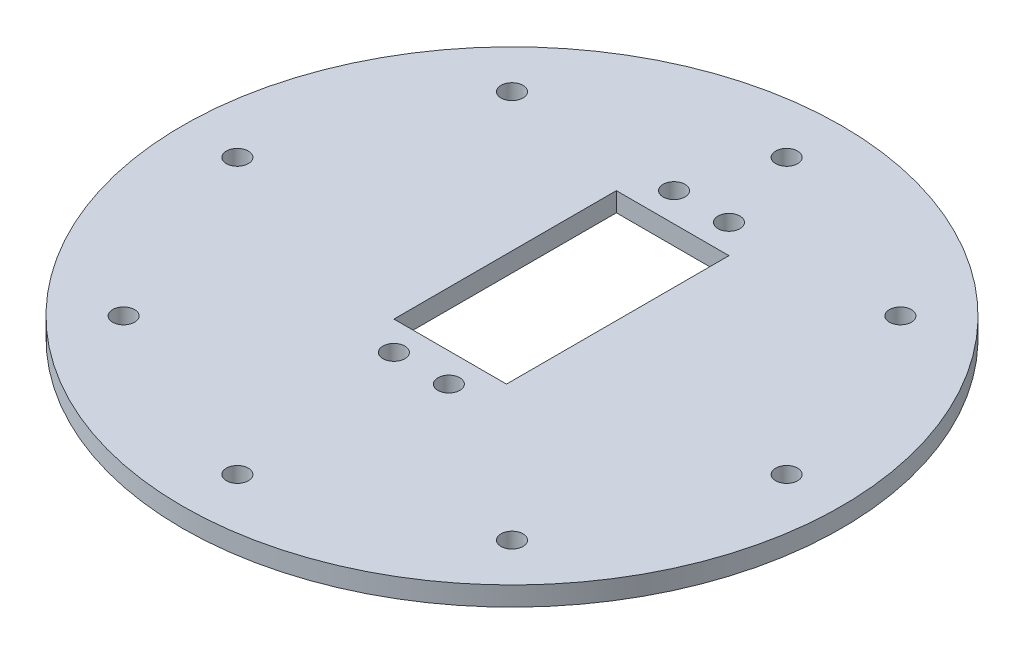
ISO-10303-21;
HEADER;
FILE_DESCRIPTION(('STEP AP214'),'2;1');
FILE_NAME('part.step','',(''),(''),'','','');
FILE_SCHEMA(('AUTOMOTIVE_DESIGN { 1 0 10303 214 1 1 1 1 }'));
ENDSEC;
DATA;
#1=APPLICATION_CONTEXT('core data for automotive mechanical design processes');
#2=APPLICATION_PROTOCOL_DEFINITION('international standard','automotive_design',2000,#1);
#3=PRODUCT_CONTEXT('',#1,'mechanical');
#4=PRODUCT('Part','Part','',(#3));
#5=PRODUCT_RELATED_PRODUCT_CATEGORY('part','',(#4));
#6=PRODUCT_DEFINITION_FORMATION('','',#4);
#7=PRODUCT_DEFINITION_CONTEXT('part definition',#1,'design');
#8=PRODUCT_DEFINITION('design','',#6,#7);
#9=PRODUCT_DEFINITION_SHAPE('','',#8);
#10=(LENGTH_UNIT() NAMED_UNIT(*) SI_UNIT(.MILLI.,.METRE.));
#11=(NAMED_UNIT(*) PLANE_ANGLE_UNIT() SI_UNIT($,.RADIAN.));
#12=(NAMED_UNIT(*) SI_UNIT($,.STERADIAN.) SOLID_ANGLE_UNIT());
#13=UNCERTAINTY_MEASURE_WITH_UNIT(LENGTH_MEASURE(1.E-05),#10,'distance_accuracy_value','');
#14=(GEOMETRIC_REPRESENTATION_CONTEXT(3) GLOBAL_UNCERTAINTY_ASSIGNED_CONTEXT((#13)) GLOBAL_UNIT_ASSIGNED_CONTEXT((#10,
#11,#12)) REPRESENTATION_CONTEXT('',''));
#15=CARTESIAN_POINT('',(0.,0.,0.));
#16=DIRECTION('',(0.,0.,1.));
#17=DIRECTION('',(1.,0.,0.));
#18=AXIS2_PLACEMENT_3D('',#15,#16,#17);
#19=CARTESIAN_POINT('',(0.,3.5,0.));
#20=DIRECTION('',(0.,-1.,0.));
#21=DIRECTION('',(0.,0.,-1.));
#22=AXIS2_PLACEMENT_3D('',#19,#20,#21);
#23=CYLINDRICAL_SURFACE('',#22,60.);
#24=CARTESIAN_POINT('',(0.,3.5,0.));
#25=DIRECTION('',(0.,1.,0.));
#26=DIRECTION('',(0.,0.,1.));
#27=AXIS2_PLACEMENT_3D('',#24,#25,#26);
#28=CIRCLE('',#27,60.);
#29=CARTESIAN_POINT('',(0.,3.5,60.));
#30=VERTEX_POINT('',#29);
#31=EDGE_CURVE('E11',#30,#30,#28,.T.);
#32=ORIENTED_EDGE('',*,*,#31,.F.);
#33=EDGE_LOOP('',(#32));
#34=FACE_BOUND('',#33,.T.);
#35=CARTESIAN_POINT('',(0.,0.,0.));
#36=DIRECTION('',(0.,1.,0.));
#37=DIRECTION('',(0.,0.,1.));
#38=AXIS2_PLACEMENT_3D('',#35,#36,#37);
#39=CIRCLE('',#38,60.);
#40=CARTESIAN_POINT('',(0.,0.,60.));
#41=VERTEX_POINT('',#40);
#42=EDGE_CURVE('E43',#41,#41,#39,.T.);
#43=ORIENTED_EDGE('',*,*,#42,.T.);
#44=EDGE_LOOP('',(#43));
#45=FACE_BOUND('',#44,.T.);
#46=ADVANCED_FACE('F40',(#34,#45),#23,.T.);
#47=CARTESIAN_POINT('',(0.,3.5,0.));
#48=DIRECTION('',(0.,1.,0.));
#49=DIRECTION('',(0.,0.,1.));
#50=AXIS2_PLACEMENT_3D('',#47,#48,#49);
#51=PLANE('',#50);
#52=CARTESIAN_POINT('',(5.,3.5,16.5));
#53=DIRECTION('',(0.,1.,0.));
#54=DIRECTION('',(0.,0.,-1.));
#55=AXIS2_PLACEMENT_3D('',#52,#53,#54);
#56=CIRCLE('',#55,2.);
#57=CARTESIAN_POINT('',(5.,3.5,14.5));
#58=VERTEX_POINT('',#57);
#59=EDGE_CURVE('E437',#58,#58,#56,.T.);
#60=ORIENTED_EDGE('',*,*,#59,.F.);
#61=EDGE_LOOP('',(#60));
#62=FACE_BOUND('',#61,.T.);
#63=CARTESIAN_POINT('',(-5.,3.5,16.5));
#64=DIRECTION('',(0.,1.,0.));
#65=DIRECTION('',(0.,0.,1.));
#66=AXIS2_PLACEMENT_3D('',#63,#64,#65);
#67=CIRCLE('',#66,2.);
#68=CARTESIAN_POINT('',(-5.,3.5,18.5));
#69=VERTEX_POINT('',#68);
#70=EDGE_CURVE('E444',#69,#69,#67,.T.);
#71=ORIENTED_EDGE('',*,*,#70,.F.);
#72=EDGE_LOOP('',(#71));
#73=FACE_BOUND('',#72,.T.);
#74=CARTESIAN_POINT('',(-5.,3.5,-34.5));
#75=DIRECTION('',(0.,1.,0.));
#76=DIRECTION('',(0.,0.,-1.));
#77=AXIS2_PLACEMENT_3D('',#74,#75,#76);
#78=CIRCLE('',#77,2.);
#79=CARTESIAN_POINT('',(-5.,3.5,-36.5));
#80=VERTEX_POINT('',#79);
#81=EDGE_CURVE('E436',#80,#80,#78,.T.);
#82=ORIENTED_EDGE('',*,*,#81,.F.);
#83=EDGE_LOOP('',(#82));
#84=FACE_BOUND('',#83,.T.);
#85=CARTESIAN_POINT('',(5.,3.5,-34.5));
#86=DIRECTION('',(0.,1.,0.));
#87=DIRECTION('',(0.,0.,1.));
#88=AXIS2_PLACEMENT_3D('',#85,#86,#87);
#89=CIRCLE('',#88,2.);
#90=CARTESIAN_POINT('',(5.,3.5,-32.5));
#91=VERTEX_POINT('',#90);
#92=EDGE_CURVE('E431',#91,#91,#89,.T.);
#93=ORIENTED_EDGE('',*,*,#92,.F.);
#94=EDGE_LOOP('',(#93));
#95=FACE_BOUND('',#94,.T.);
#96=DIRECTION('',(0.,0.,1.));
#97=VECTOR('',#96,1.);
#98=CARTESIAN_POINT('',(-10.25,3.5,-29.25));
#99=LINE('',#98,#97);
#100=CARTESIAN_POINT('',(-10.25,3.5,-29.25));
#101=VERTEX_POINT('',#100);
#102=CARTESIAN_POINT('',(-10.25,3.5,11.25));
#103=VERTEX_POINT('',#102);
#104=EDGE_CURVE('E54',#101,#103,#99,.T.);
#105=ORIENTED_EDGE('',*,*,#104,.F.);
#106=DIRECTION('',(-1.,0.,0.));
#107=VECTOR('',#106,1.);
#108=CARTESIAN_POINT('',(10.25,3.5,-29.25));
#109=LINE('',#108,#107);
#110=CARTESIAN_POINT('',(10.25,3.5,-29.25));
#111=VERTEX_POINT('',#110);
#112=EDGE_CURVE('E88',#111,#101,#109,.T.);
#113=ORIENTED_EDGE('',*,*,#112,.F.);
#114=DIRECTION('',(0.,0.,-1.));
#115=VECTOR('',#114,1.);
#116=CARTESIAN_POINT('',(10.25,3.5,-29.25));
#117=LINE('',#116,#115);
#118=CARTESIAN_POINT('',(10.25,3.5,11.25));
#119=VERTEX_POINT('',#118);
#120=EDGE_CURVE('E108',#119,#111,#117,.T.);
#121=ORIENTED_EDGE('',*,*,#120,.F.);
#122=DIRECTION('',(1.,0.,0.));
#123=VECTOR('',#122,1.);
#124=CARTESIAN_POINT('',(10.25,3.5,11.25));
#125=LINE('',#124,#123);
#126=EDGE_CURVE('E102',#103,#119,#125,.T.);
#127=ORIENTED_EDGE('',*,*,#126,.F.);
#128=EDGE_LOOP('',(#105,#113,#121,#127));
#129=FACE_BOUND('',#128,.T.);
#130=CARTESIAN_POINT('',(-50.,3.5,1.74574066942157E-13));
#131=DIRECTION('',(0.,1.,0.));
#132=DIRECTION('',(1.,0.,0.));
#133=AXIS2_PLACEMENT_3D('',#130,#131,#132);
#134=CIRCLE('',#133,2.);
#135=CARTESIAN_POINT('',(-48.,3.5,1.6759110426447E-13));
#136=VERTEX_POINT('',#135);
#137=EDGE_CURVE('E129',#136,#136,#134,.T.);
#138=ORIENTED_EDGE('',*,*,#137,.F.);
#139=EDGE_LOOP('',(#138));
#140=FACE_BOUND('',#139,.T.);
#141=CARTESIAN_POINT('',(-35.3553390593272,3.5,35.3553390593276));
#142=DIRECTION('',(0.,1.,0.));
#143=DIRECTION('',(0.707106781186544,0.,-0.707106781186551));
#144=AXIS2_PLACEMENT_3D('',#141,#142,#143);
#145=CIRCLE('',#144,2.);
#146=CARTESIAN_POINT('',(-33.9411254969541,3.5,33.9411254969545));
#147=VERTEX_POINT('',#146);
#148=EDGE_CURVE('E137',#147,#147,#145,.T.);
#149=ORIENTED_EDGE('',*,*,#148,.F.);
#150=EDGE_LOOP('',(#149));
#151=FACE_BOUND('',#150,.T.);
#152=CARTESIAN_POINT('',(0.,3.5,50.));
#153=DIRECTION('',(0.,1.,0.));
#154=DIRECTION('',(0.,0.,-1.));
#155=AXIS2_PLACEMENT_3D('',#152,#153,#154);
#156=CIRCLE('',#155,2.);
#157=CARTESIAN_POINT('',(0.,3.5,48.));
#158=VERTEX_POINT('',#157);
#159=EDGE_CURVE('E143',#158,#158,#156,.T.);
#160=ORIENTED_EDGE('',*,*,#159,.F.);
#161=EDGE_LOOP('',(#160));
#162=FACE_BOUND('',#161,.T.);
#163=CARTESIAN_POINT('',(35.3553390593277,3.5,35.3553390593271));
#164=DIRECTION('',(0.,1.,0.));
#165=DIRECTION('',(-0.707106781186554,0.,-0.707106781186541));
#166=AXIS2_PLACEMENT_3D('',#163,#164,#165);
#167=CIRCLE('',#166,2.);
#168=CARTESIAN_POINT('',(33.9411254969546,3.5,33.941125496954));
#169=VERTEX_POINT('',#168);
#170=EDGE_CURVE('E124',#169,#169,#167,.T.);
#171=ORIENTED_EDGE('',*,*,#170,.F.);
#172=EDGE_LOOP('',(#171));
#173=FACE_BOUND('',#172,.T.);
#174=CARTESIAN_POINT('',(50.,3.5,-5.2372220082647E-13));
#175=DIRECTION('',(0.,1.,0.));
#176=DIRECTION('',(-1.,0.,0.));
#177=AXIS2_PLACEMENT_3D('',#174,#175,#176);
#178=CIRCLE('',#177,2.);
#179=CARTESIAN_POINT('',(48.,3.5,-5.02773312793411E-13));
#180=VERTEX_POINT('',#179);
#181=EDGE_CURVE('E117',#180,#180,#178,.T.);
#182=ORIENTED_EDGE('',*,*,#181,.F.);
#183=EDGE_LOOP('',(#182));
#184=FACE_BOUND('',#183,.T.);
#185=CARTESIAN_POINT('',(35.3553390593269,3.5,-35.3553390593278));
#186=DIRECTION('',(0.,1.,0.));
#187=DIRECTION('',(-0.707106781186539,0.,0.707106781186556));
#188=AXIS2_PLACEMENT_3D('',#185,#186,#187);
#189=CIRCLE('',#188,2.);
#190=CARTESIAN_POINT('',(33.9411254969539,3.5,-33.9411254969547));
#191=VERTEX_POINT('',#190);
#192=EDGE_CURVE('E94',#191,#191,#189,.T.);
#193=ORIENTED_EDGE('',*,*,#192,.F.);
#194=EDGE_LOOP('',(#193));
#195=FACE_BOUND('',#194,.T.);
#196=CARTESIAN_POINT('',(-35.3553390593274,3.5,-35.3553390593273));
#197=DIRECTION('',(0.,1.,0.));
#198=DIRECTION('',(0.707106781186549,0.,0.707106781186546));
#199=AXIS2_PLACEMENT_3D('',#196,#197,#198);
#200=CIRCLE('',#199,2.);
#201=CARTESIAN_POINT('',(-33.9411254969543,3.5,-33.9411254969542));
#202=VERTEX_POINT('',#201);
#203=EDGE_CURVE('E136',#202,#202,#200,.T.);
#204=ORIENTED_EDGE('',*,*,#203,.F.);
#205=EDGE_LOOP('',(#204));
#206=FACE_BOUND('',#205,.T.);
#207=CARTESIAN_POINT('',(0.,3.5,-50.));
#208=DIRECTION('',(0.,1.,0.));
#209=DIRECTION('',(0.,0.,1.));
#210=AXIS2_PLACEMENT_3D('',#207,#208,#209);
#211=CIRCLE('',#210,2.);
#212=CARTESIAN_POINT('',(0.,3.5,-48.));
#213=VERTEX_POINT('',#212);
#214=EDGE_CURVE('E158',#213,#213,#211,.T.);
#215=ORIENTED_EDGE('',*,*,#214,.F.);
#216=EDGE_LOOP('',(#215));
#217=FACE_BOUND('',#216,.T.);
#218=ORIENTED_EDGE('',*,*,#31,.T.);
#219=EDGE_LOOP('',(#218));
#220=FACE_BOUND('',#219,.T.);
#221=ADVANCED_FACE('F171',(#62,#73,#84,#95,#129,#140,#151,#162,#173,#184,#195,#206,#217,#220),
#51,.T.);
#222=CARTESIAN_POINT('',(0.,0.,0.));
#223=DIRECTION('',(0.,1.,0.));
#224=DIRECTION('',(0.,0.,1.));
#225=AXIS2_PLACEMENT_3D('',#222,#223,#224);
#226=PLANE('',#225);
#227=CARTESIAN_POINT('',(5.,0.,16.5));
#228=DIRECTION('',(0.,1.,0.));
#229=DIRECTION('',(0.,0.,1.));
#230=AXIS2_PLACEMENT_3D('',#227,#228,#229);
#231=CIRCLE('',#230,2.);
#232=CARTESIAN_POINT('',(5.,0.,18.5));
#233=VERTEX_POINT('',#232);
#234=EDGE_CURVE('E441',#233,#233,#231,.F.);
#235=ORIENTED_EDGE('',*,*,#234,.F.);
#236=EDGE_LOOP('',(#235));
#237=FACE_BOUND('',#236,.T.);
#238=CARTESIAN_POINT('',(-5.,0.,16.5));
#239=DIRECTION('',(0.,1.,0.));
#240=DIRECTION('',(0.,0.,1.));
#241=AXIS2_PLACEMENT_3D('',#238,#239,#240);
#242=CIRCLE('',#241,2.);
#243=CARTESIAN_POINT('',(-5.,0.,18.5));
#244=VERTEX_POINT('',#243);
#245=EDGE_CURVE('E440',#244,#244,#242,.F.);
#246=ORIENTED_EDGE('',*,*,#245,.F.);
#247=EDGE_LOOP('',(#246));
#248=FACE_BOUND('',#247,.T.);
#249=CARTESIAN_POINT('',(-5.,0.,-34.5));
#250=DIRECTION('',(0.,1.,0.));
#251=DIRECTION('',(0.,0.,1.));
#252=AXIS2_PLACEMENT_3D('',#249,#250,#251);
#253=CIRCLE('',#252,2.);
#254=CARTESIAN_POINT('',(-5.,0.,-32.5));
#255=VERTEX_POINT('',#254);
#256=EDGE_CURVE('E447',#255,#255,#253,.F.);
#257=ORIENTED_EDGE('',*,*,#256,.F.);
#258=EDGE_LOOP('',(#257));
#259=FACE_BOUND('',#258,.T.);
#260=CARTESIAN_POINT('',(5.,0.,-34.5));
#261=DIRECTION('',(0.,1.,0.));
#262=DIRECTION('',(0.,0.,1.));
#263=AXIS2_PLACEMENT_3D('',#260,#261,#262);
#264=CIRCLE('',#263,2.);
#265=CARTESIAN_POINT('',(5.,0.,-32.5));
#266=VERTEX_POINT('',#265);
#267=EDGE_CURVE('E429',#266,#266,#264,.F.);
#268=ORIENTED_EDGE('',*,*,#267,.F.);
#269=EDGE_LOOP('',(#268));
#270=FACE_BOUND('',#269,.T.);
#271=DIRECTION('',(1.,0.,0.));
#272=VECTOR('',#271,1.);
#273=CARTESIAN_POINT('',(10.25,0.,-29.25));
#274=LINE('',#273,#272);
#275=CARTESIAN_POINT('',(-10.25,0.,-29.25));
#276=VERTEX_POINT('',#275);
#277=CARTESIAN_POINT('',(10.25,0.,-29.25));
#278=VERTEX_POINT('',#277);
#279=EDGE_CURVE('E100',#276,#278,#274,.T.);
#280=ORIENTED_EDGE('',*,*,#279,.F.);
#281=DIRECTION('',(0.,0.,-1.));
#282=VECTOR('',#281,1.);
#283=CARTESIAN_POINT('',(-10.25,0.,-29.25));
#284=LINE('',#283,#282);
#285=CARTESIAN_POINT('',(-10.25,0.,11.25));
#286=VERTEX_POINT('',#285);
#287=EDGE_CURVE('E82',#286,#276,#284,.T.);
#288=ORIENTED_EDGE('',*,*,#287,.F.);
#289=DIRECTION('',(-1.,0.,0.));
#290=VECTOR('',#289,1.);
#291=CARTESIAN_POINT('',(10.25,0.,11.25));
#292=LINE('',#291,#290);
#293=CARTESIAN_POINT('',(10.25,0.,11.25));
#294=VERTEX_POINT('',#293);
#295=EDGE_CURVE('E91',#294,#286,#292,.T.);
#296=ORIENTED_EDGE('',*,*,#295,.F.);
#297=DIRECTION('',(0.,0.,1.));
#298=VECTOR('',#297,1.);
#299=CARTESIAN_POINT('',(10.25,0.,-29.25));
#300=LINE('',#299,#298);
#301=EDGE_CURVE('E62',#278,#294,#300,.T.);
#302=ORIENTED_EDGE('',*,*,#301,.F.);
#303=EDGE_LOOP('',(#280,#288,#296,#302));
#304=FACE_BOUND('',#303,.T.);
#305=CARTESIAN_POINT('',(-50.,0.,1.74574066942157E-13));
#306=DIRECTION('',(0.,1.,0.));
#307=DIRECTION('',(0.,0.,1.));
#308=AXIS2_PLACEMENT_3D('',#305,#306,#307);
#309=CIRCLE('',#308,2.);
#310=CARTESIAN_POINT('',(-50.,0.,2.00000000000018));
#311=VERTEX_POINT('',#310);
#312=EDGE_CURVE('E132',#311,#311,#309,.F.);
#313=ORIENTED_EDGE('',*,*,#312,.F.);
#314=EDGE_LOOP('',(#313));
#315=FACE_BOUND('',#314,.T.);
#316=CARTESIAN_POINT('',(-35.3553390593272,0.,35.3553390593276));
#317=DIRECTION('',(0.,1.,0.));
#318=DIRECTION('',(0.,0.,1.));
#319=AXIS2_PLACEMENT_3D('',#316,#317,#318);
#320=CIRCLE('',#319,2.);
#321=CARTESIAN_POINT('',(-35.3553390593272,0.,37.3553390593276));
#322=VERTEX_POINT('',#321);
#323=EDGE_CURVE('E133',#322,#322,#320,.F.);
#324=ORIENTED_EDGE('',*,*,#323,.F.);
#325=EDGE_LOOP('',(#324));
#326=FACE_BOUND('',#325,.T.);
#327=CARTESIAN_POINT('',(0.,0.,50.));
#328=DIRECTION('',(0.,1.,0.));
#329=DIRECTION('',(0.,0.,1.));
#330=AXIS2_PLACEMENT_3D('',#327,#328,#329);
#331=CIRCLE('',#330,2.);
#332=CARTESIAN_POINT('',(0.,0.,52.));
#333=VERTEX_POINT('',#332);
#334=EDGE_CURVE('E140',#333,#333,#331,.F.);
#335=ORIENTED_EDGE('',*,*,#334,.F.);
#336=EDGE_LOOP('',(#335));
#337=FACE_BOUND('',#336,.T.);
#338=CARTESIAN_POINT('',(35.3553390593277,0.,35.3553390593271));
#339=DIRECTION('',(0.,1.,0.));
#340=DIRECTION('',(0.,0.,1.));
#341=AXIS2_PLACEMENT_3D('',#338,#339,#340);
#342=CIRCLE('',#341,2.);
#343=CARTESIAN_POINT('',(35.3553390593277,0.,37.3553390593271));
#344=VERTEX_POINT('',#343);
#345=EDGE_CURVE('E146',#344,#344,#342,.F.);
#346=ORIENTED_EDGE('',*,*,#345,.F.);
#347=EDGE_LOOP('',(#346));
#348=FACE_BOUND('',#347,.T.);
#349=CARTESIAN_POINT('',(50.,0.,-5.2372220082647E-13));
#350=DIRECTION('',(0.,1.,0.));
#351=DIRECTION('',(0.,0.,1.));
#352=AXIS2_PLACEMENT_3D('',#349,#350,#351);
#353=CIRCLE('',#352,2.);
#354=CARTESIAN_POINT('',(50.,0.,1.99999999999948));
#355=VERTEX_POINT('',#354);
#356=EDGE_CURVE('E120',#355,#355,#353,.F.);
#357=ORIENTED_EDGE('',*,*,#356,.F.);
#358=EDGE_LOOP('',(#357));
#359=FACE_BOUND('',#358,.T.);
#360=CARTESIAN_POINT('',(35.3553390593269,0.,-35.3553390593278));
#361=DIRECTION('',(0.,1.,0.));
#362=DIRECTION('',(0.,0.,1.));
#363=AXIS2_PLACEMENT_3D('',#360,#361,#362);
#364=CIRCLE('',#363,2.);
#365=CARTESIAN_POINT('',(35.3553390593269,0.,-33.3553390593278));
#366=VERTEX_POINT('',#365);
#367=EDGE_CURVE('E121',#366,#366,#364,.F.);
#368=ORIENTED_EDGE('',*,*,#367,.F.);
#369=EDGE_LOOP('',(#368));
#370=FACE_BOUND('',#369,.T.);
#371=CARTESIAN_POINT('',(-35.3553390593274,0.,-35.3553390593273));
#372=DIRECTION('',(0.,1.,0.));
#373=DIRECTION('',(0.,0.,1.));
#374=AXIS2_PLACEMENT_3D('',#371,#372,#373);
#375=CIRCLE('',#374,2.);
#376=CARTESIAN_POINT('',(-35.3553390593274,0.,-33.3553390593273));
#377=VERTEX_POINT('',#376);
#378=EDGE_CURVE('E155',#377,#377,#375,.F.);
#379=ORIENTED_EDGE('',*,*,#378,.F.);
#380=EDGE_LOOP('',(#379));
#381=FACE_BOUND('',#380,.T.);
#382=CARTESIAN_POINT('',(0.,0.,-50.));
#383=DIRECTION('',(0.,1.,0.));
#384=DIRECTION('',(0.,0.,1.));
#385=AXIS2_PLACEMENT_3D('',#382,#383,#384);
#386=CIRCLE('',#385,2.);
#387=CARTESIAN_POINT('',(0.,0.,-48.));
#388=VERTEX_POINT('',#387);
#389=EDGE_CURVE('E161',#388,#388,#386,.F.);
#390=ORIENTED_EDGE('',*,*,#389,.F.);
#391=EDGE_LOOP('',(#390));
#392=FACE_BOUND('',#391,.T.);
#393=ORIENTED_EDGE('',*,*,#42,.F.);
#394=EDGE_LOOP('',(#393));
#395=FACE_BOUND('',#394,.T.);
#396=ADVANCED_FACE('F97',(#237,#248,#259,#270,#304,#315,#326,#337,#348,#359,#370,#381,#392,
#395),#226,.F.);
#397=CARTESIAN_POINT('',(0.,-0.00100000000000013,-50.));
#398=DIRECTION('',(0.,1.,0.));
#399=DIRECTION('',(0.,0.,1.));
#400=AXIS2_PLACEMENT_3D('',#397,#398,#399);
#401=CYLINDRICAL_SURFACE('',#400,2.);
#402=ORIENTED_EDGE('',*,*,#214,.T.);
#403=EDGE_LOOP('',(#402));
#404=FACE_BOUND('',#403,.T.);
#405=ORIENTED_EDGE('',*,*,#389,.T.);
#406=EDGE_LOOP('',(#405));
#407=FACE_BOUND('',#406,.T.);
#408=ADVANCED_FACE('F170',(#404,#407),#401,.F.);
#409=CARTESIAN_POINT('',(-35.3553390593274,-0.00100000000000013,-35.3553390593273));
#410=DIRECTION('',(0.,1.,0.));
#411=DIRECTION('',(0.,0.,1.));
#412=AXIS2_PLACEMENT_3D('',#409,#410,#411);
#413=CYLINDRICAL_SURFACE('',#412,2.);
#414=ORIENTED_EDGE('',*,*,#203,.T.);
#415=EDGE_LOOP('',(#414));
#416=FACE_BOUND('',#415,.T.);
#417=ORIENTED_EDGE('',*,*,#378,.T.);
#418=EDGE_LOOP('',(#417));
#419=FACE_BOUND('',#418,.T.);
#420=ADVANCED_FACE('F177',(#416,#419),#413,.F.);
#421=CARTESIAN_POINT('',(35.3553390593269,-0.00100000000000013,-35.3553390593278));
#422=DIRECTION('',(0.,1.,0.));
#423=DIRECTION('',(0.,0.,1.));
#424=AXIS2_PLACEMENT_3D('',#421,#422,#423);
#425=CYLINDRICAL_SURFACE('',#424,2.);
#426=ORIENTED_EDGE('',*,*,#192,.T.);
#427=EDGE_LOOP('',(#426));
#428=FACE_BOUND('',#427,.T.);
#429=ORIENTED_EDGE('',*,*,#367,.T.);
#430=EDGE_LOOP('',(#429));
#431=FACE_BOUND('',#430,.T.);
#432=ADVANCED_FACE('F336',(#428,#431),#425,.F.);
#433=CARTESIAN_POINT('',(50.,-0.00100000000000013,-5.2372220082647E-13));
#434=DIRECTION('',(0.,1.,0.));
#435=DIRECTION('',(0.,0.,1.));
#436=AXIS2_PLACEMENT_3D('',#433,#434,#435);
#437=CYLINDRICAL_SURFACE('',#436,2.);
#438=ORIENTED_EDGE('',*,*,#181,.T.);
#439=EDGE_LOOP('',(#438));
#440=FACE_BOUND('',#439,.T.);
#441=ORIENTED_EDGE('',*,*,#356,.T.);
#442=EDGE_LOOP('',(#441));
#443=FACE_BOUND('',#442,.T.);
#444=ADVANCED_FACE('F326',(#440,#443),#437,.F.);
#445=CARTESIAN_POINT('',(35.3553390593277,-0.00100000000000013,35.3553390593271));
#446=DIRECTION('',(0.,1.,0.));
#447=DIRECTION('',(0.,0.,1.));
#448=AXIS2_PLACEMENT_3D('',#445,#446,#447);
#449=CYLINDRICAL_SURFACE('',#448,2.);
#450=ORIENTED_EDGE('',*,*,#170,.T.);
#451=EDGE_LOOP('',(#450));
#452=FACE_BOUND('',#451,.T.);
#453=ORIENTED_EDGE('',*,*,#345,.T.);
#454=EDGE_LOOP('',(#453));
#455=FACE_BOUND('',#454,.T.);
#456=ADVANCED_FACE('F316',(#452,#455),#449,.F.);
#457=CARTESIAN_POINT('',(0.,-0.00100000000000013,50.));
#458=DIRECTION('',(0.,1.,0.));
#459=DIRECTION('',(0.,0.,1.));
#460=AXIS2_PLACEMENT_3D('',#457,#458,#459);
#461=CYLINDRICAL_SURFACE('',#460,2.);
#462=ORIENTED_EDGE('',*,*,#159,.T.);
#463=EDGE_LOOP('',(#462));
#464=FACE_BOUND('',#463,.T.);
#465=ORIENTED_EDGE('',*,*,#334,.T.);
#466=EDGE_LOOP('',(#465));
#467=FACE_BOUND('',#466,.T.);
#468=ADVANCED_FACE('F306',(#464,#467),#461,.F.);
#469=CARTESIAN_POINT('',(-35.3553390593272,-0.00100000000000013,35.3553390593276));
#470=DIRECTION('',(0.,1.,0.));
#471=DIRECTION('',(0.,0.,1.));
#472=AXIS2_PLACEMENT_3D('',#469,#470,#471);
#473=CYLINDRICAL_SURFACE('',#472,2.);
#474=ORIENTED_EDGE('',*,*,#148,.T.);
#475=EDGE_LOOP('',(#474));
#476=FACE_BOUND('',#475,.T.);
#477=ORIENTED_EDGE('',*,*,#323,.T.);
#478=EDGE_LOOP('',(#477));
#479=FACE_BOUND('',#478,.T.);
#480=ADVANCED_FACE('F296',(#476,#479),#473,.F.);
#481=CARTESIAN_POINT('',(-50.,-0.00100000000000013,1.74574066942157E-13));
#482=DIRECTION('',(0.,1.,0.));
#483=DIRECTION('',(0.,0.,1.));
#484=AXIS2_PLACEMENT_3D('',#481,#482,#483);
#485=CYLINDRICAL_SURFACE('',#484,2.);
#486=ORIENTED_EDGE('',*,*,#137,.T.);
#487=EDGE_LOOP('',(#486));
#488=FACE_BOUND('',#487,.T.);
#489=ORIENTED_EDGE('',*,*,#312,.T.);
#490=EDGE_LOOP('',(#489));
#491=FACE_BOUND('',#490,.T.);
#492=ADVANCED_FACE('F287',(#488,#491),#485,.F.);
#493=CARTESIAN_POINT('',(-10.25,-0.00100000000000013,-29.25));
#494=DIRECTION('',(-1.,0.,0.));
#495=DIRECTION('',(0.,0.,1.));
#496=AXIS2_PLACEMENT_3D('',#493,#494,#495);
#497=PLANE('',#496);
#498=ORIENTED_EDGE('',*,*,#287,.T.);
#499=DIRECTION('',(0.,1.,0.));
#500=VECTOR('',#499,1.);
#501=CARTESIAN_POINT('',(-10.25,-0.00100000000000013,-29.25));
#502=LINE('',#501,#500);
#503=EDGE_CURVE('E95',#276,#101,#502,.T.);
#504=ORIENTED_EDGE('',*,*,#503,.T.);
#505=ORIENTED_EDGE('',*,*,#104,.T.);
#506=DIRECTION('',(0.,1.,0.));
#507=VECTOR('',#506,1.);
#508=CARTESIAN_POINT('',(-10.25,-0.00100000000000013,11.25));
#509=LINE('',#508,#507);
#510=EDGE_CURVE('E78',#286,#103,#509,.T.);
#511=ORIENTED_EDGE('',*,*,#510,.F.);
#512=EDGE_LOOP('',(#498,#504,#505,#511));
#513=FACE_BOUND('',#512,.T.);
#514=ADVANCED_FACE('F80',(#513),#497,.F.);
#515=CARTESIAN_POINT('',(10.25,-0.00100000000000013,-29.25));
#516=DIRECTION('',(0.,0.,-1.));
#517=DIRECTION('',(-1.,0.,0.));
#518=AXIS2_PLACEMENT_3D('',#515,#516,#517);
#519=PLANE('',#518);
#520=ORIENTED_EDGE('',*,*,#279,.T.);
#521=DIRECTION('',(0.,1.,0.));
#522=VECTOR('',#521,1.);
#523=CARTESIAN_POINT('',(10.25,-0.00100000000000013,-29.25));
#524=LINE('',#523,#522);
#525=EDGE_CURVE('E114',#278,#111,#524,.T.);
#526=ORIENTED_EDGE('',*,*,#525,.T.);
#527=ORIENTED_EDGE('',*,*,#112,.T.);
#528=ORIENTED_EDGE('',*,*,#503,.F.);
#529=EDGE_LOOP('',(#520,#526,#527,#528));
#530=FACE_BOUND('',#529,.T.);
#531=ADVANCED_FACE('F270',(#530),#519,.F.);
#532=CARTESIAN_POINT('',(10.25,-0.00100000000000013,-29.25));
#533=DIRECTION('',(1.,0.,0.));
#534=DIRECTION('',(0.,0.,-1.));
#535=AXIS2_PLACEMENT_3D('',#532,#533,#534);
#536=PLANE('',#535);
#537=ORIENTED_EDGE('',*,*,#301,.T.);
#538=DIRECTION('',(0.,1.,0.));
#539=VECTOR('',#538,1.);
#540=CARTESIAN_POINT('',(10.25,-0.00100000000000013,11.25));
#541=LINE('',#540,#539);
#542=EDGE_CURVE('E87',#294,#119,#541,.T.);
#543=ORIENTED_EDGE('',*,*,#542,.T.);
#544=ORIENTED_EDGE('',*,*,#120,.T.);
#545=ORIENTED_EDGE('',*,*,#525,.F.);
#546=EDGE_LOOP('',(#537,#543,#544,#545));
#547=FACE_BOUND('',#546,.T.);
#548=ADVANCED_FACE('F262',(#547),#536,.F.);
#549=CARTESIAN_POINT('',(10.25,-0.00100000000000013,11.25));
#550=DIRECTION('',(0.,0.,1.));
#551=DIRECTION('',(1.,0.,0.));
#552=AXIS2_PLACEMENT_3D('',#549,#550,#551);
#553=PLANE('',#552);
#554=ORIENTED_EDGE('',*,*,#295,.T.);
#555=ORIENTED_EDGE('',*,*,#510,.T.);
#556=ORIENTED_EDGE('',*,*,#126,.T.);
#557=ORIENTED_EDGE('',*,*,#542,.F.);
#558=EDGE_LOOP('',(#554,#555,#556,#557));
#559=FACE_BOUND('',#558,.T.);
#560=ADVANCED_FACE('F92',(#559),#553,.F.);
#561=CARTESIAN_POINT('',(5.,-0.00100000000000013,-34.5));
#562=DIRECTION('',(0.,1.,0.));
#563=DIRECTION('',(0.,0.,1.));
#564=AXIS2_PLACEMENT_3D('',#561,#562,#563);
#565=CYLINDRICAL_SURFACE('',#564,2.);
#566=ORIENTED_EDGE('',*,*,#92,.T.);
#567=EDGE_LOOP('',(#566));
#568=FACE_BOUND('',#567,.T.);
#569=ORIENTED_EDGE('',*,*,#267,.T.);
#570=EDGE_LOOP('',(#569));
#571=FACE_BOUND('',#570,.T.);
#572=ADVANCED_FACE('F212',(#568,#571),#565,.F.);
#573=CARTESIAN_POINT('',(-5.,-0.00100000000000013,-34.5));
#574=DIRECTION('',(0.,1.,0.));
#575=DIRECTION('',(0.,0.,1.));
#576=AXIS2_PLACEMENT_3D('',#573,#574,#575);
#577=CYLINDRICAL_SURFACE('',#576,2.);
#578=ORIENTED_EDGE('',*,*,#81,.T.);
#579=EDGE_LOOP('',(#578));
#580=FACE_BOUND('',#579,.T.);
#581=ORIENTED_EDGE('',*,*,#256,.T.);
#582=EDGE_LOOP('',(#581));
#583=FACE_BOUND('',#582,.T.);
#584=ADVANCED_FACE('F217',(#580,#583),#577,.F.);
#585=CARTESIAN_POINT('',(-5.,-0.00100000000000013,16.5));
#586=DIRECTION('',(0.,1.,0.));
#587=DIRECTION('',(0.,0.,1.));
#588=AXIS2_PLACEMENT_3D('',#585,#586,#587);
#589=CYLINDRICAL_SURFACE('',#588,2.);
#590=ORIENTED_EDGE('',*,*,#70,.T.);
#591=EDGE_LOOP('',(#590));
#592=FACE_BOUND('',#591,.T.);
#593=ORIENTED_EDGE('',*,*,#245,.T.);
#594=EDGE_LOOP('',(#593));
#595=FACE_BOUND('',#594,.T.);
#596=ADVANCED_FACE('F228',(#592,#595),#589,.F.);
#597=CARTESIAN_POINT('',(5.,-0.00100000000000013,16.5));
#598=DIRECTION('',(0.,1.,0.));
#599=DIRECTION('',(0.,0.,1.));
#600=AXIS2_PLACEMENT_3D('',#597,#598,#599);
#601=CYLINDRICAL_SURFACE('',#600,2.);
#602=ORIENTED_EDGE('',*,*,#59,.T.);
#603=EDGE_LOOP('',(#602));
#604=FACE_BOUND('',#603,.T.);
#605=ORIENTED_EDGE('',*,*,#234,.T.);
#606=EDGE_LOOP('',(#605));
#607=FACE_BOUND('',#606,.T.);
#608=ADVANCED_FACE('F239',(#604,#607),#601,.F.);
#609=CLOSED_SHELL('',(#46,#221,#396,#408,#420,#432,#444,#456,#468,#480,#492,#514,#531,#548,#560,
#572,#584,#596,#608));
#610=MANIFOLD_SOLID_BREP('B2',#609);
#611=ADVANCED_BREP_SHAPE_REPRESENTATION('',(#18,#610),#14);
#612=SHAPE_DEFINITION_REPRESENTATION(#9,#611);
ENDSEC;
END-ISO-10303-21;
